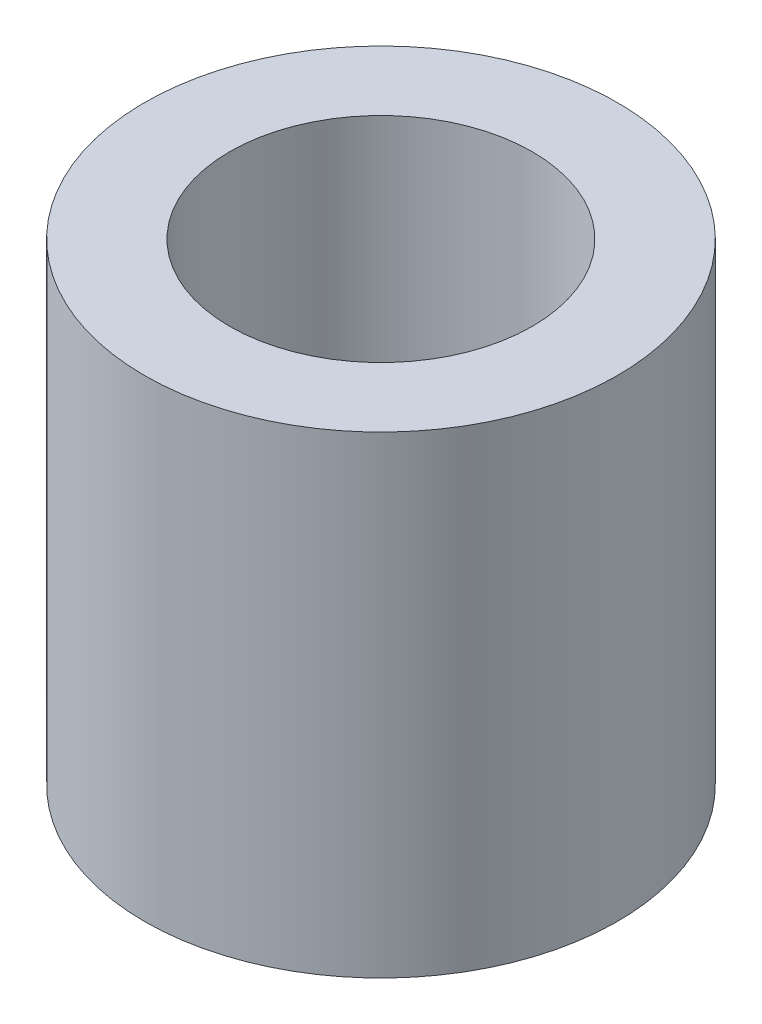
ISO-10303-21;
HEADER;
FILE_DESCRIPTION(('STEP AP214'),'2;1');
FILE_NAME('part.step','',(''),(''),'','','');
FILE_SCHEMA(('AUTOMOTIVE_DESIGN { 1 0 10303 214 1 1 1 1 }'));
ENDSEC;
DATA;
#1=APPLICATION_CONTEXT('core data for automotive mechanical design processes');
#2=APPLICATION_PROTOCOL_DEFINITION('international standard','automotive_design',2000,#1);
#3=PRODUCT_CONTEXT('',#1,'mechanical');
#4=PRODUCT('Part','Part','',(#3));
#5=PRODUCT_RELATED_PRODUCT_CATEGORY('part','',(#4));
#6=PRODUCT_DEFINITION_FORMATION('','',#4);
#7=PRODUCT_DEFINITION_CONTEXT('part definition',#1,'design');
#8=PRODUCT_DEFINITION('design','',#6,#7);
#9=PRODUCT_DEFINITION_SHAPE('','',#8);
#10=(LENGTH_UNIT() NAMED_UNIT(*) SI_UNIT(.MILLI.,.METRE.));
#11=(NAMED_UNIT(*) PLANE_ANGLE_UNIT() SI_UNIT($,.RADIAN.));
#12=(NAMED_UNIT(*) SI_UNIT($,.STERADIAN.) SOLID_ANGLE_UNIT());
#13=UNCERTAINTY_MEASURE_WITH_UNIT(LENGTH_MEASURE(1.E-05),#10,'distance_accuracy_value','');
#14=(GEOMETRIC_REPRESENTATION_CONTEXT(3) GLOBAL_UNCERTAINTY_ASSIGNED_CONTEXT((#13)) GLOBAL_UNIT_ASSIGNED_CONTEXT((#10,
#11,#12)) REPRESENTATION_CONTEXT('',''));
#15=CARTESIAN_POINT('',(0.,0.,0.));
#16=DIRECTION('',(0.,0.,1.));
#17=DIRECTION('',(1.,0.,0.));
#18=AXIS2_PLACEMENT_3D('',#15,#16,#17);
#19=CARTESIAN_POINT('',(0.,-2.5,0.));
#20=DIRECTION('',(0.,1.,0.));
#21=DIRECTION('',(0.,0.,1.));
#22=AXIS2_PLACEMENT_3D('',#19,#20,#21);
#23=CYLINDRICAL_SURFACE('',#22,2.5);
#24=CARTESIAN_POINT('',(0.,-2.5,0.));
#25=DIRECTION('',(0.,1.,0.));
#26=DIRECTION('',(0.,0.,1.));
#27=AXIS2_PLACEMENT_3D('',#24,#25,#26);
#28=CIRCLE('',#27,2.5);
#29=CARTESIAN_POINT('',(0.,-2.5,2.5));
#30=VERTEX_POINT('',#29);
#31=EDGE_CURVE('E10',#30,#30,#28,.T.);
#32=ORIENTED_EDGE('',*,*,#31,.T.);
#33=EDGE_LOOP('',(#32));
#34=FACE_BOUND('',#33,.T.);
#35=CARTESIAN_POINT('',(0.,2.5,0.));
#36=DIRECTION('',(0.,1.,0.));
#37=DIRECTION('',(0.,0.,1.));
#38=AXIS2_PLACEMENT_3D('',#35,#36,#37);
#39=CIRCLE('',#38,2.5);
#40=CARTESIAN_POINT('',(0.,2.5,2.5));
#41=VERTEX_POINT('',#40);
#42=EDGE_CURVE('E53',#41,#41,#39,.T.);
#43=ORIENTED_EDGE('',*,*,#42,.F.);
#44=EDGE_LOOP('',(#43));
#45=FACE_BOUND('',#44,.T.);
#46=ADVANCED_FACE('F41',(#34,#45),#23,.T.);
#47=CARTESIAN_POINT('',(0.,-2.5,0.));
#48=DIRECTION('',(0.,1.,0.));
#49=DIRECTION('',(0.,0.,1.));
#50=AXIS2_PLACEMENT_3D('',#47,#48,#49);
#51=PLANE('',#50);
#52=CARTESIAN_POINT('',(0.,-2.5,0.));
#53=DIRECTION('',(0.,1.,0.));
#54=DIRECTION('',(0.,0.,1.));
#55=AXIS2_PLACEMENT_3D('',#52,#53,#54);
#56=CIRCLE('',#55,1.6);
#57=CARTESIAN_POINT('',(0.,-2.5,1.6));
#58=VERTEX_POINT('',#57);
#59=EDGE_CURVE('E48',#58,#58,#56,.T.);
#60=ORIENTED_EDGE('',*,*,#59,.T.);
#61=EDGE_LOOP('',(#60));
#62=FACE_BOUND('',#61,.T.);
#63=ORIENTED_EDGE('',*,*,#31,.F.);
#64=EDGE_LOOP('',(#63));
#65=FACE_BOUND('',#64,.T.);
#66=ADVANCED_FACE('F74',(#62,#65),#51,.F.);
#67=CARTESIAN_POINT('',(0.,-2.5,0.));
#68=DIRECTION('',(0.,1.,0.));
#69=DIRECTION('',(0.,0.,1.));
#70=AXIS2_PLACEMENT_3D('',#67,#68,#69);
#71=CYLINDRICAL_SURFACE('',#70,1.6);
#72=ORIENTED_EDGE('',*,*,#59,.F.);
#73=EDGE_LOOP('',(#72));
#74=FACE_BOUND('',#73,.T.);
#75=CARTESIAN_POINT('',(0.,2.5,0.));
#76=DIRECTION('',(0.,1.,0.));
#77=DIRECTION('',(0.,0.,1.));
#78=AXIS2_PLACEMENT_3D('',#75,#76,#77);
#79=CIRCLE('',#78,1.6);
#80=CARTESIAN_POINT('',(0.,2.5,1.6));
#81=VERTEX_POINT('',#80);
#82=EDGE_CURVE('E58',#81,#81,#79,.T.);
#83=ORIENTED_EDGE('',*,*,#82,.T.);
#84=EDGE_LOOP('',(#83));
#85=FACE_BOUND('',#84,.T.);
#86=ADVANCED_FACE('F65',(#74,#85),#71,.F.);
#87=CARTESIAN_POINT('',(0.,2.5,0.));
#88=DIRECTION('',(0.,1.,0.));
#89=DIRECTION('',(0.,0.,1.));
#90=AXIS2_PLACEMENT_3D('',#87,#88,#89);
#91=PLANE('',#90);
#92=ORIENTED_EDGE('',*,*,#42,.T.);
#93=EDGE_LOOP('',(#92));
#94=FACE_BOUND('',#93,.T.);
#95=ORIENTED_EDGE('',*,*,#82,.F.);
#96=EDGE_LOOP('',(#95));
#97=FACE_BOUND('',#96,.T.);
#98=ADVANCED_FACE('F67',(#94,#97),#91,.T.);
#99=CLOSED_SHELL('',(#46,#66,#86,#98));
#100=MANIFOLD_SOLID_BREP('B2',#99);
#101=ADVANCED_BREP_SHAPE_REPRESENTATION('',(#18,#100),#14);
#102=SHAPE_DEFINITION_REPRESENTATION(#9,#101);
ENDSEC;
END-ISO-10303-21;
